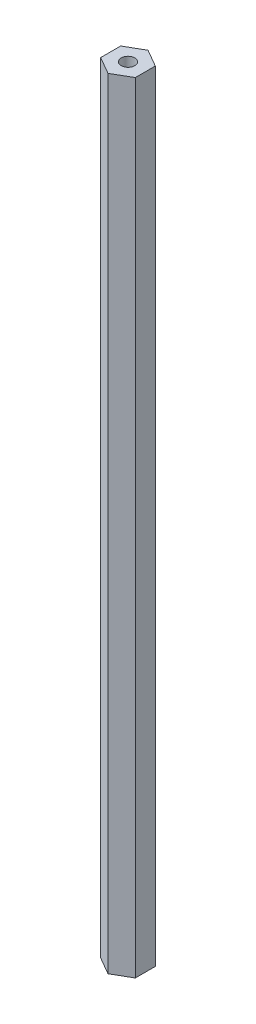
ISO-10303-21;
HEADER;
FILE_DESCRIPTION(('STEP AP214'),'2;1');
FILE_NAME('part.step','',(''),(''),'','','');
FILE_SCHEMA(('AUTOMOTIVE_DESIGN { 1 0 10303 214 1 1 1 1 }'));
ENDSEC;
DATA;
#1=APPLICATION_CONTEXT('core data for automotive mechanical design processes');
#2=APPLICATION_PROTOCOL_DEFINITION('international standard','automotive_design',2000,#1);
#3=PRODUCT_CONTEXT('',#1,'mechanical');
#4=PRODUCT('Part','Part','',(#3));
#5=PRODUCT_RELATED_PRODUCT_CATEGORY('part','',(#4));
#6=PRODUCT_DEFINITION_FORMATION('','',#4);
#7=PRODUCT_DEFINITION_CONTEXT('part definition',#1,'design');
#8=PRODUCT_DEFINITION('design','',#6,#7);
#9=PRODUCT_DEFINITION_SHAPE('','',#8);
#10=(LENGTH_UNIT() NAMED_UNIT(*) SI_UNIT(.MILLI.,.METRE.));
#11=(NAMED_UNIT(*) PLANE_ANGLE_UNIT() SI_UNIT($,.RADIAN.));
#12=(NAMED_UNIT(*) SI_UNIT($,.STERADIAN.) SOLID_ANGLE_UNIT());
#13=UNCERTAINTY_MEASURE_WITH_UNIT(LENGTH_MEASURE(1.E-05),#10,'distance_accuracy_value','');
#14=(GEOMETRIC_REPRESENTATION_CONTEXT(3) GLOBAL_UNCERTAINTY_ASSIGNED_CONTEXT((#13)) GLOBAL_UNIT_ASSIGNED_CONTEXT((#10,
#11,#12)) REPRESENTATION_CONTEXT('',''));
#15=CARTESIAN_POINT('',(0.,0.,0.));
#16=DIRECTION('',(0.,0.,1.));
#17=DIRECTION('',(1.,0.,0.));
#18=AXIS2_PLACEMENT_3D('',#15,#16,#17);
#19=CARTESIAN_POINT('',(6.35,285.75,3.66617420935412));
#20=DIRECTION('',(-1.,0.,0.));
#21=DIRECTION('',(0.,0.,1.));
#22=AXIS2_PLACEMENT_3D('',#19,#20,#21);
#23=PLANE('',#22);
#24=DIRECTION('',(0.,0.,-1.));
#25=VECTOR('',#24,1.);
#26=CARTESIAN_POINT('',(6.35,0.,3.66617420935412));
#27=LINE('',#26,#25);
#28=CARTESIAN_POINT('',(6.35,0.,3.66617420935412));
#29=VERTEX_POINT('',#28);
#30=CARTESIAN_POINT('',(6.35,0.,-3.66617420935412));
#31=VERTEX_POINT('',#30);
#32=EDGE_CURVE('E117',#29,#31,#27,.T.);
#33=ORIENTED_EDGE('',*,*,#32,.T.);
#34=DIRECTION('',(0.,-1.,0.));
#35=VECTOR('',#34,1.);
#36=CARTESIAN_POINT('',(6.35,285.75,-3.66617420935412));
#37=LINE('',#36,#35);
#38=CARTESIAN_POINT('',(6.35,285.75,-3.66617420935412));
#39=VERTEX_POINT('',#38);
#40=EDGE_CURVE('E11',#39,#31,#37,.T.);
#41=ORIENTED_EDGE('',*,*,#40,.F.);
#42=DIRECTION('',(0.,0.,-1.));
#43=VECTOR('',#42,1.);
#44=CARTESIAN_POINT('',(6.35,285.75,3.66617420935412));
#45=LINE('',#44,#43);
#46=CARTESIAN_POINT('',(6.35,285.75,3.66617420935412));
#47=VERTEX_POINT('',#46);
#48=EDGE_CURVE('E128',#47,#39,#45,.T.);
#49=ORIENTED_EDGE('',*,*,#48,.F.);
#50=DIRECTION('',(0.,-1.,0.));
#51=VECTOR('',#50,1.);
#52=CARTESIAN_POINT('',(6.35,285.75,3.66617420935412));
#53=LINE('',#52,#51);
#54=EDGE_CURVE('E113',#47,#29,#53,.T.);
#55=ORIENTED_EDGE('',*,*,#54,.T.);
#56=EDGE_LOOP('',(#33,#41,#49,#55));
#57=FACE_BOUND('',#56,.T.);
#58=ADVANCED_FACE('F33',(#57),#23,.F.);
#59=CARTESIAN_POINT('',(6.35,285.75,-3.66617420935412));
#60=DIRECTION('',(-0.5,0.,0.866025403784439));
#61=DIRECTION('',(0.866025403784439,0.,0.5));
#62=AXIS2_PLACEMENT_3D('',#59,#60,#61);
#63=PLANE('',#62);
#64=DIRECTION('',(-0.866025403784439,0.,-0.5));
#65=VECTOR('',#64,1.);
#66=CARTESIAN_POINT('',(6.35,0.,-3.66617420935412));
#67=LINE('',#66,#65);
#68=CARTESIAN_POINT('',(0.,0.,-7.33234841870824));
#69=VERTEX_POINT('',#68);
#70=EDGE_CURVE('E120',#31,#69,#67,.T.);
#71=ORIENTED_EDGE('',*,*,#70,.T.);
#72=DIRECTION('',(0.,-1.,0.));
#73=VECTOR('',#72,1.);
#74=CARTESIAN_POINT('',(0.,285.75,-7.33234841870824));
#75=LINE('',#74,#73);
#76=CARTESIAN_POINT('',(0.,285.75,-7.33234841870824));
#77=VERTEX_POINT('',#76);
#78=EDGE_CURVE('E41',#77,#69,#75,.T.);
#79=ORIENTED_EDGE('',*,*,#78,.F.);
#80=DIRECTION('',(-0.866025403784439,0.,-0.5));
#81=VECTOR('',#80,1.);
#82=CARTESIAN_POINT('',(6.35,285.75,-3.66617420935412));
#83=LINE('',#82,#81);
#84=EDGE_CURVE('E86',#39,#77,#83,.T.);
#85=ORIENTED_EDGE('',*,*,#84,.F.);
#86=ORIENTED_EDGE('',*,*,#40,.T.);
#87=EDGE_LOOP('',(#71,#79,#85,#86));
#88=FACE_BOUND('',#87,.T.);
#89=ADVANCED_FACE('F153',(#88),#63,.F.);
#90=CARTESIAN_POINT('',(0.,285.75,-7.33234841870824));
#91=DIRECTION('',(0.5,0.,0.866025403784438));
#92=DIRECTION('',(0.866025403784438,0.,-0.5));
#93=AXIS2_PLACEMENT_3D('',#90,#91,#92);
#94=PLANE('',#93);
#95=DIRECTION('',(-0.866025403784438,0.,0.5));
#96=VECTOR('',#95,1.);
#97=CARTESIAN_POINT('',(0.,0.,-7.33234841870824));
#98=LINE('',#97,#96);
#99=CARTESIAN_POINT('',(-6.35,0.,-3.66617420935412));
#100=VERTEX_POINT('',#99);
#101=EDGE_CURVE('E123',#69,#100,#98,.T.);
#102=ORIENTED_EDGE('',*,*,#101,.T.);
#103=DIRECTION('',(0.,-1.,0.));
#104=VECTOR('',#103,1.);
#105=CARTESIAN_POINT('',(-6.35,285.75,-3.66617420935412));
#106=LINE('',#105,#104);
#107=CARTESIAN_POINT('',(-6.35,285.75,-3.66617420935412));
#108=VERTEX_POINT('',#107);
#109=EDGE_CURVE('E108',#108,#100,#106,.T.);
#110=ORIENTED_EDGE('',*,*,#109,.F.);
#111=DIRECTION('',(-0.866025403784438,0.,0.5));
#112=VECTOR('',#111,1.);
#113=CARTESIAN_POINT('',(0.,285.75,-7.33234841870824));
#114=LINE('',#113,#112);
#115=EDGE_CURVE('E99',#77,#108,#114,.T.);
#116=ORIENTED_EDGE('',*,*,#115,.F.);
#117=ORIENTED_EDGE('',*,*,#78,.T.);
#118=EDGE_LOOP('',(#102,#110,#116,#117));
#119=FACE_BOUND('',#118,.T.);
#120=ADVANCED_FACE('F134',(#119),#94,.F.);
#121=CARTESIAN_POINT('',(-6.35,285.75,-3.66617420935412));
#122=DIRECTION('',(1.,0.,0.));
#123=DIRECTION('',(0.,0.,-1.));
#124=AXIS2_PLACEMENT_3D('',#121,#122,#123);
#125=PLANE('',#124);
#126=DIRECTION('',(0.,0.,1.));
#127=VECTOR('',#126,1.);
#128=CARTESIAN_POINT('',(-6.35,0.,-3.66617420935412));
#129=LINE('',#128,#127);
#130=CARTESIAN_POINT('',(-6.35,0.,3.66617420935413));
#131=VERTEX_POINT('',#130);
#132=EDGE_CURVE('E107',#100,#131,#129,.T.);
#133=ORIENTED_EDGE('',*,*,#132,.T.);
#134=DIRECTION('',(0.,-1.,0.));
#135=VECTOR('',#134,1.);
#136=CARTESIAN_POINT('',(-6.35,285.75,3.66617420935413));
#137=LINE('',#136,#135);
#138=CARTESIAN_POINT('',(-6.35,285.75,3.66617420935413));
#139=VERTEX_POINT('',#138);
#140=EDGE_CURVE('E104',#139,#131,#137,.T.);
#141=ORIENTED_EDGE('',*,*,#140,.F.);
#142=DIRECTION('',(0.,0.,1.));
#143=VECTOR('',#142,1.);
#144=CARTESIAN_POINT('',(-6.35,285.75,-3.66617420935412));
#145=LINE('',#144,#143);
#146=EDGE_CURVE('E93',#108,#139,#145,.T.);
#147=ORIENTED_EDGE('',*,*,#146,.F.);
#148=ORIENTED_EDGE('',*,*,#109,.T.);
#149=EDGE_LOOP('',(#133,#141,#147,#148));
#150=FACE_BOUND('',#149,.T.);
#151=ADVANCED_FACE('F105',(#150),#125,.F.);
#152=CARTESIAN_POINT('',(-6.35,285.75,3.66617420935413));
#153=DIRECTION('',(0.5,0.,-0.866025403784439));
#154=DIRECTION('',(-0.866025403784439,0.,-0.5));
#155=AXIS2_PLACEMENT_3D('',#152,#153,#154);
#156=PLANE('',#155);
#157=DIRECTION('',(0.866025403784439,0.,0.5));
#158=VECTOR('',#157,1.);
#159=CARTESIAN_POINT('',(-6.35,0.,3.66617420935413));
#160=LINE('',#159,#158);
#161=CARTESIAN_POINT('',(0.,0.,7.33234841870825));
#162=VERTEX_POINT('',#161);
#163=EDGE_CURVE('E72',#131,#162,#160,.T.);
#164=ORIENTED_EDGE('',*,*,#163,.T.);
#165=DIRECTION('',(0.,-1.,0.));
#166=VECTOR('',#165,1.);
#167=CARTESIAN_POINT('',(0.,285.75,7.33234841870825));
#168=LINE('',#167,#166);
#169=CARTESIAN_POINT('',(0.,285.75,7.33234841870825));
#170=VERTEX_POINT('',#169);
#171=EDGE_CURVE('E109',#170,#162,#168,.T.);
#172=ORIENTED_EDGE('',*,*,#171,.F.);
#173=DIRECTION('',(0.866025403784439,0.,0.5));
#174=VECTOR('',#173,1.);
#175=CARTESIAN_POINT('',(-6.35,285.75,3.66617420935413));
#176=LINE('',#175,#174);
#177=EDGE_CURVE('E97',#139,#170,#176,.T.);
#178=ORIENTED_EDGE('',*,*,#177,.F.);
#179=ORIENTED_EDGE('',*,*,#140,.T.);
#180=EDGE_LOOP('',(#164,#172,#178,#179));
#181=FACE_BOUND('',#180,.T.);
#182=ADVANCED_FACE('F111',(#181),#156,.F.);
#183=CARTESIAN_POINT('',(0.,285.75,7.33234841870825));
#184=DIRECTION('',(-0.5,0.,-0.866025403784439));
#185=DIRECTION('',(-0.866025403784439,0.,0.5));
#186=AXIS2_PLACEMENT_3D('',#183,#184,#185);
#187=PLANE('',#186);
#188=DIRECTION('',(0.866025403784438,0.,-0.5));
#189=VECTOR('',#188,1.);
#190=CARTESIAN_POINT('',(0.,0.,7.33234841870825));
#191=LINE('',#190,#189);
#192=EDGE_CURVE('E78',#162,#29,#191,.T.);
#193=ORIENTED_EDGE('',*,*,#192,.T.);
#194=ORIENTED_EDGE('',*,*,#54,.F.);
#195=DIRECTION('',(0.866025403784438,0.,-0.5));
#196=VECTOR('',#195,1.);
#197=CARTESIAN_POINT('',(0.,285.75,7.33234841870825));
#198=LINE('',#197,#196);
#199=EDGE_CURVE('E49',#170,#47,#198,.T.);
#200=ORIENTED_EDGE('',*,*,#199,.F.);
#201=ORIENTED_EDGE('',*,*,#171,.T.);
#202=EDGE_LOOP('',(#193,#194,#200,#201));
#203=FACE_BOUND('',#202,.T.);
#204=ADVANCED_FACE('F141',(#203),#187,.F.);
#205=CARTESIAN_POINT('',(0.,285.75,0.));
#206=DIRECTION('',(0.,1.,0.));
#207=DIRECTION('',(0.,0.,1.));
#208=AXIS2_PLACEMENT_3D('',#205,#206,#207);
#209=PLANE('',#208);
#210=CARTESIAN_POINT('',(0.,285.75,0.));
#211=DIRECTION('',(0.,1.,0.));
#212=DIRECTION('',(0.,0.,1.));
#213=AXIS2_PLACEMENT_3D('',#210,#211,#212);
#214=CIRCLE('',#213,2.4892);
#215=CARTESIAN_POINT('',(0.,285.75,2.4892));
#216=VERTEX_POINT('',#215);
#217=EDGE_CURVE('E237',#216,#216,#214,.T.);
#218=ORIENTED_EDGE('',*,*,#217,.F.);
#219=EDGE_LOOP('',(#218));
#220=FACE_BOUND('',#219,.T.);
#221=ORIENTED_EDGE('',*,*,#48,.T.);
#222=ORIENTED_EDGE('',*,*,#84,.T.);
#223=ORIENTED_EDGE('',*,*,#115,.T.);
#224=ORIENTED_EDGE('',*,*,#146,.T.);
#225=ORIENTED_EDGE('',*,*,#177,.T.);
#226=ORIENTED_EDGE('',*,*,#199,.T.);
#227=EDGE_LOOP('',(#221,#222,#223,#224,#225,#226));
#228=FACE_BOUND('',#227,.T.);
#229=ADVANCED_FACE('F95',(#220,#228),#209,.T.);
#230=CARTESIAN_POINT('',(0.,0.,0.));
#231=DIRECTION('',(0.,1.,0.));
#232=DIRECTION('',(0.,0.,1.));
#233=AXIS2_PLACEMENT_3D('',#230,#231,#232);
#234=PLANE('',#233);
#235=CARTESIAN_POINT('',(0.,0.,0.));
#236=DIRECTION('',(0.,-1.,0.));
#237=DIRECTION('',(0.,0.,-1.));
#238=AXIS2_PLACEMENT_3D('',#235,#236,#237);
#239=CIRCLE('',#238,2.4892);
#240=CARTESIAN_POINT('',(0.,0.,-2.4892));
#241=VERTEX_POINT('',#240);
#242=EDGE_CURVE('E236',#241,#241,#239,.T.);
#243=ORIENTED_EDGE('',*,*,#242,.F.);
#244=EDGE_LOOP('',(#243));
#245=FACE_BOUND('',#244,.T.);
#246=ORIENTED_EDGE('',*,*,#32,.F.);
#247=ORIENTED_EDGE('',*,*,#192,.F.);
#248=ORIENTED_EDGE('',*,*,#163,.F.);
#249=ORIENTED_EDGE('',*,*,#132,.F.);
#250=ORIENTED_EDGE('',*,*,#101,.F.);
#251=ORIENTED_EDGE('',*,*,#70,.F.);
#252=EDGE_LOOP('',(#246,#247,#248,#249,#250,#251));
#253=FACE_BOUND('',#252,.T.);
#254=ADVANCED_FACE('F137',(#245,#253),#234,.F.);
#255=CARTESIAN_POINT('',(0.,25.4,0.));
#256=DIRECTION('',(0.,-1.,0.));
#257=DIRECTION('',(0.,0.,-1.));
#258=AXIS2_PLACEMENT_3D('',#255,#256,#257);
#259=CYLINDRICAL_SURFACE('',#258,2.4892);
#260=CARTESIAN_POINT('',(0.,25.4,0.));
#261=DIRECTION('',(0.,-1.,0.));
#262=DIRECTION('',(0.,0.,-1.));
#263=AXIS2_PLACEMENT_3D('',#260,#261,#262);
#264=CIRCLE('',#263,2.4892);
#265=CARTESIAN_POINT('',(0.,25.4,-2.4892));
#266=VERTEX_POINT('',#265);
#267=EDGE_CURVE('E121',#266,#266,#264,.T.);
#268=ORIENTED_EDGE('',*,*,#267,.F.);
#269=EDGE_LOOP('',(#268));
#270=FACE_BOUND('',#269,.T.);
#271=ORIENTED_EDGE('',*,*,#242,.T.);
#272=EDGE_LOOP('',(#271));
#273=FACE_BOUND('',#272,.T.);
#274=ADVANCED_FACE('F185',(#270,#273),#259,.F.);
#275=CARTESIAN_POINT('',(0.,25.4,0.));
#276=DIRECTION('',(0.,-1.,0.));
#277=DIRECTION('',(0.,0.,-1.));
#278=AXIS2_PLACEMENT_3D('',#275,#276,#277);
#279=PLANE('',#278);
#280=ORIENTED_EDGE('',*,*,#267,.T.);
#281=EDGE_LOOP('',(#280));
#282=FACE_BOUND('',#281,.T.);
#283=ADVANCED_FACE('F194',(#282),#279,.T.);
#284=CARTESIAN_POINT('',(0.,260.35,0.));
#285=DIRECTION('',(0.,1.,0.));
#286=DIRECTION('',(0.,0.,1.));
#287=AXIS2_PLACEMENT_3D('',#284,#285,#286);
#288=CYLINDRICAL_SURFACE('',#287,2.4892);
#289=CARTESIAN_POINT('',(0.,260.35,0.));
#290=DIRECTION('',(0.,1.,0.));
#291=DIRECTION('',(0.,0.,1.));
#292=AXIS2_PLACEMENT_3D('',#289,#290,#291);
#293=CIRCLE('',#292,2.4892);
#294=CARTESIAN_POINT('',(0.,260.35,2.4892));
#295=VERTEX_POINT('',#294);
#296=EDGE_CURVE('E235',#295,#295,#293,.T.);
#297=ORIENTED_EDGE('',*,*,#296,.F.);
#298=EDGE_LOOP('',(#297));
#299=FACE_BOUND('',#298,.T.);
#300=ORIENTED_EDGE('',*,*,#217,.T.);
#301=EDGE_LOOP('',(#300));
#302=FACE_BOUND('',#301,.T.);
#303=ADVANCED_FACE('F204',(#299,#302),#288,.F.);
#304=CARTESIAN_POINT('',(0.,260.35,0.));
#305=DIRECTION('',(0.,1.,0.));
#306=DIRECTION('',(0.,0.,1.));
#307=AXIS2_PLACEMENT_3D('',#304,#305,#306);
#308=PLANE('',#307);
#309=ORIENTED_EDGE('',*,*,#296,.T.);
#310=EDGE_LOOP('',(#309));
#311=FACE_BOUND('',#310,.T.);
#312=ADVANCED_FACE('F219',(#311),#308,.T.);
#313=CLOSED_SHELL('',(#58,#89,#120,#151,#182,#204,#229,#254,#274,#283,#303,#312));
#314=MANIFOLD_SOLID_BREP('B2',#313);
#315=ADVANCED_BREP_SHAPE_REPRESENTATION('',(#18,#314),#14);
#316=SHAPE_DEFINITION_REPRESENTATION(#9,#315);
ENDSEC;
END-ISO-10303-21;
